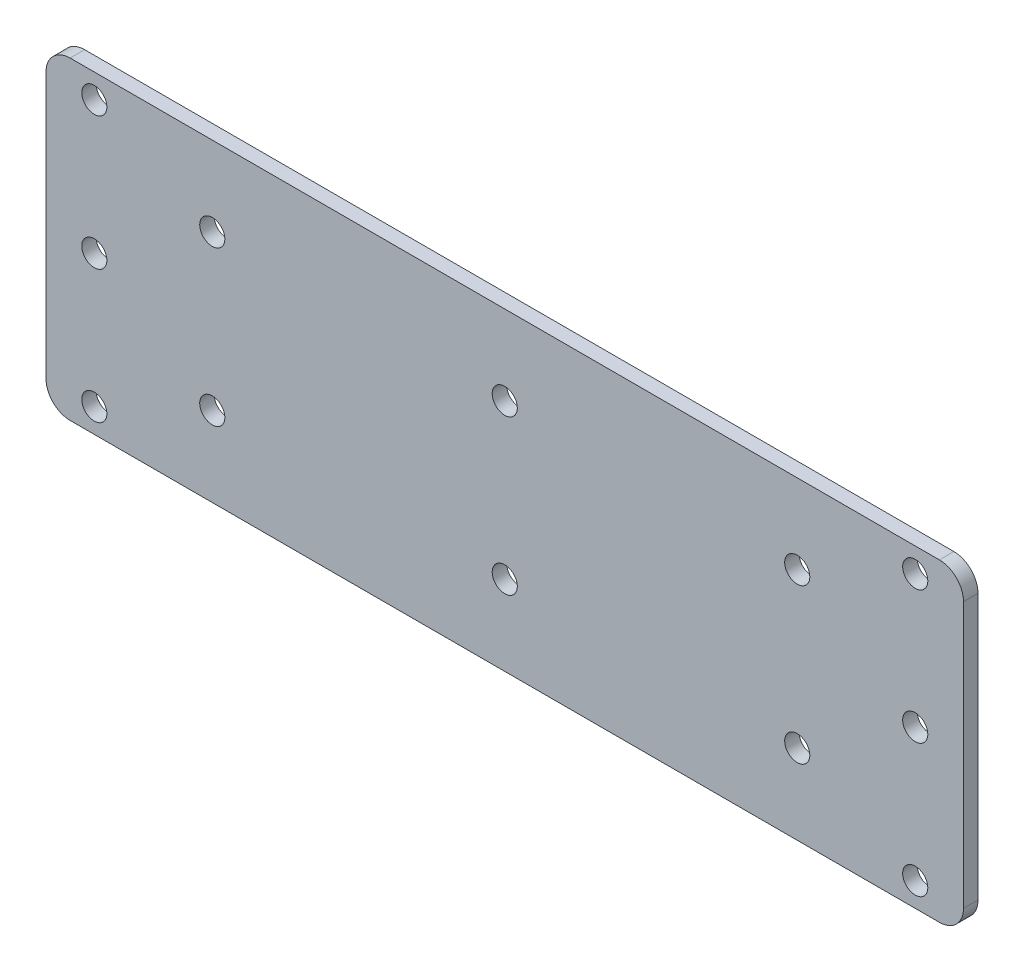
ISO-10303-21;
HEADER;
FILE_DESCRIPTION(('STEP AP214'),'2;1');
FILE_NAME('part.step','',(''),(''),'','','');
FILE_SCHEMA(('AUTOMOTIVE_DESIGN { 1 0 10303 214 1 1 1 1 }'));
ENDSEC;
DATA;
#1=APPLICATION_CONTEXT('core data for automotive mechanical design processes');
#2=APPLICATION_PROTOCOL_DEFINITION('international standard','automotive_design',2000,#1);
#3=PRODUCT_CONTEXT('',#1,'mechanical');
#4=PRODUCT('Part','Part','',(#3));
#5=PRODUCT_RELATED_PRODUCT_CATEGORY('part','',(#4));
#6=PRODUCT_DEFINITION_FORMATION('','',#4);
#7=PRODUCT_DEFINITION_CONTEXT('part definition',#1,'design');
#8=PRODUCT_DEFINITION('design','',#6,#7);
#9=PRODUCT_DEFINITION_SHAPE('','',#8);
#10=(LENGTH_UNIT() NAMED_UNIT(*) SI_UNIT(.MILLI.,.METRE.));
#11=(NAMED_UNIT(*) PLANE_ANGLE_UNIT() SI_UNIT($,.RADIAN.));
#12=(NAMED_UNIT(*) SI_UNIT($,.STERADIAN.) SOLID_ANGLE_UNIT());
#13=UNCERTAINTY_MEASURE_WITH_UNIT(LENGTH_MEASURE(1.E-05),#10,'distance_accuracy_value','');
#14=(GEOMETRIC_REPRESENTATION_CONTEXT(3) GLOBAL_UNCERTAINTY_ASSIGNED_CONTEXT((#13)) GLOBAL_UNIT_ASSIGNED_CONTEXT((#10,
#11,#12)) REPRESENTATION_CONTEXT('',''));
#15=CARTESIAN_POINT('',(0.,0.,0.));
#16=DIRECTION('',(0.,0.,1.));
#17=DIRECTION('',(1.,0.,0.));
#18=AXIS2_PLACEMENT_3D('',#15,#16,#17);
#19=CARTESIAN_POINT('',(0.,0.,3.));
#20=DIRECTION('',(0.,0.,1.));
#21=DIRECTION('',(1.,0.,0.));
#22=AXIS2_PLACEMENT_3D('',#19,#20,#21);
#23=PLANE('',#22);
#24=CARTESIAN_POINT('',(60.5639448145122,16.0292368422705,3.));
#25=DIRECTION('',(0.,0.,-1.));
#26=DIRECTION('',(-1.,0.,0.));
#27=AXIS2_PLACEMENT_3D('',#24,#25,#26);
#28=CIRCLE('',#27,2.6);
#29=CARTESIAN_POINT('',(57.9639448145121,16.0292368422705,3.));
#30=VERTEX_POINT('',#29);
#31=EDGE_CURVE('E385',#30,#30,#28,.T.);
#32=ORIENTED_EDGE('',*,*,#31,.T.);
#33=EDGE_LOOP('',(#32));
#34=FACE_BOUND('',#33,.T.);
#35=CARTESIAN_POINT('',(84.9961701361328,0.,3.));
#36=DIRECTION('',(0.,0.,-1.));
#37=DIRECTION('',(-1.,0.,0.));
#38=AXIS2_PLACEMENT_3D('',#35,#36,#37);
#39=CIRCLE('',#38,2.6);
#40=CARTESIAN_POINT('',(82.3961701361328,0.,3.));
#41=VERTEX_POINT('',#40);
#42=EDGE_CURVE('E389',#41,#41,#39,.T.);
#43=ORIENTED_EDGE('',*,*,#42,.T.);
#44=EDGE_LOOP('',(#43));
#45=FACE_BOUND('',#44,.T.);
#46=CARTESIAN_POINT('',(60.5639448145153,-15.9707631577294,3.));
#47=DIRECTION('',(0.,0.,-1.));
#48=DIRECTION('',(-1.,0.,0.));
#49=AXIS2_PLACEMENT_3D('',#46,#47,#48);
#50=CIRCLE('',#49,2.6);
#51=CARTESIAN_POINT('',(57.9639448145153,-15.9707631577294,3.));
#52=VERTEX_POINT('',#51);
#53=EDGE_CURVE('E400',#52,#52,#50,.T.);
#54=ORIENTED_EDGE('',*,*,#53,.T.);
#55=EDGE_LOOP('',(#54));
#56=FACE_BOUND('',#55,.T.);
#57=CARTESIAN_POINT('',(84.9961701361328,-27.5127460420702,3.));
#58=DIRECTION('',(0.,0.,-1.));
#59=DIRECTION('',(-1.,0.,0.));
#60=AXIS2_PLACEMENT_3D('',#57,#58,#59);
#61=CIRCLE('',#60,2.6);
#62=CARTESIAN_POINT('',(82.3961701361328,-27.5127460420702,3.));
#63=VERTEX_POINT('',#62);
#64=EDGE_CURVE('E406',#63,#63,#61,.T.);
#65=ORIENTED_EDGE('',*,*,#64,.T.);
#66=EDGE_LOOP('',(#65));
#67=FACE_BOUND('',#66,.T.);
#68=CARTESIAN_POINT('',(-0.0019149319335672,16.0292368422705,3.));
#69=DIRECTION('',(0.,0.,-1.));
#70=DIRECTION('',(-1.,0.,0.));
#71=AXIS2_PLACEMENT_3D('',#68,#69,#70);
#72=CIRCLE('',#71,2.6);
#73=CARTESIAN_POINT('',(-2.60191493193357,16.0292368422705,3.));
#74=VERTEX_POINT('',#73);
#75=EDGE_CURVE('E412',#74,#74,#72,.T.);
#76=ORIENTED_EDGE('',*,*,#75,.T.);
#77=EDGE_LOOP('',(#76));
#78=FACE_BOUND('',#77,.T.);
#79=CARTESIAN_POINT('',(-0.00191493193357414,-15.9707631577295,3.));
#80=DIRECTION('',(0.,0.,-1.));
#81=DIRECTION('',(-1.,0.,0.));
#82=AXIS2_PLACEMENT_3D('',#79,#80,#81);
#83=CIRCLE('',#82,2.6);
#84=CARTESIAN_POINT('',(-2.60191493193358,-15.9707631577295,3.));
#85=VERTEX_POINT('',#84);
#86=EDGE_CURVE('E418',#85,#85,#83,.T.);
#87=ORIENTED_EDGE('',*,*,#86,.T.);
#88=EDGE_LOOP('',(#87));
#89=FACE_BOUND('',#88,.T.);
#90=CARTESIAN_POINT('',(-84.9999999999999,-27.5127460420702,3.));
#91=DIRECTION('',(0.,0.,-1.));
#92=DIRECTION('',(1.,0.,0.));
#93=AXIS2_PLACEMENT_3D('',#90,#91,#92);
#94=CIRCLE('',#93,2.6);
#95=CARTESIAN_POINT('',(-82.3999999999999,-27.5127460420702,3.));
#96=VERTEX_POINT('',#95);
#97=EDGE_CURVE('E424',#96,#96,#94,.T.);
#98=ORIENTED_EDGE('',*,*,#97,.T.);
#99=EDGE_LOOP('',(#98));
#100=FACE_BOUND('',#99,.T.);
#101=CARTESIAN_POINT('',(-60.5677746783824,-15.9707631577294,3.));
#102=DIRECTION('',(0.,0.,-1.));
#103=DIRECTION('',(1.,0.,0.));
#104=AXIS2_PLACEMENT_3D('',#101,#102,#103);
#105=CIRCLE('',#104,2.6);
#106=CARTESIAN_POINT('',(-57.9677746783824,-15.9707631577294,3.));
#107=VERTEX_POINT('',#106);
#108=EDGE_CURVE('E430',#107,#107,#105,.T.);
#109=ORIENTED_EDGE('',*,*,#108,.T.);
#110=EDGE_LOOP('',(#109));
#111=FACE_BOUND('',#110,.T.);
#112=CARTESIAN_POINT('',(-84.9999999999999,0.,3.));
#113=DIRECTION('',(0.,0.,-1.));
#114=DIRECTION('',(1.,0.,0.));
#115=AXIS2_PLACEMENT_3D('',#112,#113,#114);
#116=CIRCLE('',#115,2.6);
#117=CARTESIAN_POINT('',(-82.3999999999999,0.,3.));
#118=VERTEX_POINT('',#117);
#119=EDGE_CURVE('E436',#118,#118,#116,.T.);
#120=ORIENTED_EDGE('',*,*,#119,.T.);
#121=EDGE_LOOP('',(#120));
#122=FACE_BOUND('',#121,.T.);
#123=CARTESIAN_POINT('',(-60.5677746783793,16.0292368422706,3.));
#124=DIRECTION('',(0.,0.,-1.));
#125=DIRECTION('',(1.,0.,0.));
#126=AXIS2_PLACEMENT_3D('',#123,#124,#125);
#127=CIRCLE('',#126,2.6);
#128=CARTESIAN_POINT('',(-57.9677746783793,16.0292368422706,3.));
#129=VERTEX_POINT('',#128);
#130=EDGE_CURVE('E454',#129,#129,#127,.T.);
#131=ORIENTED_EDGE('',*,*,#130,.T.);
#132=EDGE_LOOP('',(#131));
#133=FACE_BOUND('',#132,.T.);
#134=CARTESIAN_POINT('',(-84.9999999999999,27.5,3.));
#135=DIRECTION('',(0.,0.,-1.));
#136=DIRECTION('',(1.,0.,0.));
#137=AXIS2_PLACEMENT_3D('',#134,#135,#136);
#138=CIRCLE('',#137,2.6);
#139=CARTESIAN_POINT('',(-82.3999999999999,27.5,3.));
#140=VERTEX_POINT('',#139);
#141=EDGE_CURVE('E462',#140,#140,#138,.T.);
#142=ORIENTED_EDGE('',*,*,#141,.T.);
#143=EDGE_LOOP('',(#142));
#144=FACE_BOUND('',#143,.T.);
#145=CARTESIAN_POINT('',(84.9961701361328,27.5,3.));
#146=DIRECTION('',(0.,0.,-1.));
#147=DIRECTION('',(-1.,0.,0.));
#148=AXIS2_PLACEMENT_3D('',#145,#146,#147);
#149=CIRCLE('',#148,2.6);
#150=CARTESIAN_POINT('',(82.3961701361328,27.5,3.));
#151=VERTEX_POINT('',#150);
#152=EDGE_CURVE('E437',#151,#151,#149,.T.);
#153=ORIENTED_EDGE('',*,*,#152,.T.);
#154=EDGE_LOOP('',(#153));
#155=FACE_BOUND('',#154,.T.);
#156=DIRECTION('',(0.,1.,0.));
#157=VECTOR('',#156,1.);
#158=CARTESIAN_POINT('',(-95.,-32.5,3.));
#159=LINE('',#158,#157);
#160=CARTESIAN_POINT('',(-95.,-27.5,3.));
#161=VERTEX_POINT('',#160);
#162=CARTESIAN_POINT('',(-94.9999999999999,27.5,3.));
#163=VERTEX_POINT('',#162);
#164=EDGE_CURVE('E122',#161,#163,#159,.T.);
#165=ORIENTED_EDGE('',*,*,#164,.F.);
#166=CARTESIAN_POINT('',(-90.,-27.5,3.));
#167=DIRECTION('',(0.,0.,1.));
#168=DIRECTION('',(1.,0.,0.));
#169=AXIS2_PLACEMENT_3D('',#166,#167,#168);
#170=CIRCLE('',#169,5.);
#171=CARTESIAN_POINT('',(-90.,-32.5,3.));
#172=VERTEX_POINT('',#171);
#173=EDGE_CURVE('E105',#161,#172,#170,.T.);
#174=ORIENTED_EDGE('',*,*,#173,.T.);
#175=DIRECTION('',(1.,0.,0.));
#176=VECTOR('',#175,1.);
#177=CARTESIAN_POINT('',(-125.,-32.5,3.));
#178=LINE('',#177,#176);
#179=CARTESIAN_POINT('',(89.9961701361328,-32.5,3.));
#180=VERTEX_POINT('',#179);
#181=EDGE_CURVE('E140',#172,#180,#178,.T.);
#182=ORIENTED_EDGE('',*,*,#181,.T.);
#183=CARTESIAN_POINT('',(89.9961701361328,-27.5,3.));
#184=DIRECTION('',(0.,0.,1.));
#185=DIRECTION('',(1.,0.,0.));
#186=AXIS2_PLACEMENT_3D('',#183,#184,#185);
#187=CIRCLE('',#186,5.);
#188=CARTESIAN_POINT('',(94.9961701361328,-27.5,3.));
#189=VERTEX_POINT('',#188);
#190=EDGE_CURVE('E126',#180,#189,#187,.T.);
#191=ORIENTED_EDGE('',*,*,#190,.T.);
#192=DIRECTION('',(0.,-1.,0.));
#193=VECTOR('',#192,1.);
#194=CARTESIAN_POINT('',(94.9961701361328,-32.5,3.));
#195=LINE('',#194,#193);
#196=CARTESIAN_POINT('',(94.9961701361328,27.5,3.));
#197=VERTEX_POINT('',#196);
#198=EDGE_CURVE('E134',#197,#189,#195,.T.);
#199=ORIENTED_EDGE('',*,*,#198,.F.);
#200=CARTESIAN_POINT('',(89.9961701361328,27.5,3.));
#201=DIRECTION('',(0.,0.,1.));
#202=DIRECTION('',(1.,0.,0.));
#203=AXIS2_PLACEMENT_3D('',#200,#201,#202);
#204=CIRCLE('',#203,5.);
#205=CARTESIAN_POINT('',(89.9961701361328,32.5,3.));
#206=VERTEX_POINT('',#205);
#207=EDGE_CURVE('E149',#197,#206,#204,.T.);
#208=ORIENTED_EDGE('',*,*,#207,.T.);
#209=DIRECTION('',(-1.,0.,0.));
#210=VECTOR('',#209,1.);
#211=CARTESIAN_POINT('',(-125.,32.5,3.));
#212=LINE('',#211,#210);
#213=CARTESIAN_POINT('',(-89.9999999999999,32.5,3.));
#214=VERTEX_POINT('',#213);
#215=EDGE_CURVE('E138',#206,#214,#212,.T.);
#216=ORIENTED_EDGE('',*,*,#215,.T.);
#217=CARTESIAN_POINT('',(-89.9999999999999,27.5,3.));
#218=DIRECTION('',(0.,0.,1.));
#219=DIRECTION('',(1.,0.,0.));
#220=AXIS2_PLACEMENT_3D('',#217,#218,#219);
#221=CIRCLE('',#220,5.);
#222=EDGE_CURVE('E116',#214,#163,#221,.T.);
#223=ORIENTED_EDGE('',*,*,#222,.T.);
#224=EDGE_LOOP('',(#165,#174,#182,#191,#199,#208,#216,#223));
#225=FACE_BOUND('',#224,.T.);
#226=ADVANCED_FACE('F39',(#34,#45,#56,#67,#78,#89,#100,#111,#122,#133,#144,#155,#225),#23,.T.);
#227=CARTESIAN_POINT('',(0.,0.,0.));
#228=DIRECTION('',(0.,0.,1.));
#229=DIRECTION('',(1.,0.,0.));
#230=AXIS2_PLACEMENT_3D('',#227,#228,#229);
#231=PLANE('',#230);
#232=CARTESIAN_POINT('',(60.5639448145122,16.0292368422705,0.));
#233=DIRECTION('',(0.,0.,-1.));
#234=DIRECTION('',(-1.,0.,0.));
#235=AXIS2_PLACEMENT_3D('',#232,#233,#234);
#236=CIRCLE('',#235,2.6);
#237=CARTESIAN_POINT('',(57.9639448145121,16.0292368422705,0.));
#238=VERTEX_POINT('',#237);
#239=EDGE_CURVE('E388',#238,#238,#236,.T.);
#240=ORIENTED_EDGE('',*,*,#239,.F.);
#241=EDGE_LOOP('',(#240));
#242=FACE_BOUND('',#241,.T.);
#243=CARTESIAN_POINT('',(84.9961701361328,0.,0.));
#244=DIRECTION('',(0.,0.,-1.));
#245=DIRECTION('',(-1.,0.,0.));
#246=AXIS2_PLACEMENT_3D('',#243,#244,#245);
#247=CIRCLE('',#246,2.6);
#248=CARTESIAN_POINT('',(82.3961701361328,0.,0.));
#249=VERTEX_POINT('',#248);
#250=EDGE_CURVE('E394',#249,#249,#247,.T.);
#251=ORIENTED_EDGE('',*,*,#250,.F.);
#252=EDGE_LOOP('',(#251));
#253=FACE_BOUND('',#252,.T.);
#254=CARTESIAN_POINT('',(60.5639448145153,-15.9707631577294,0.));
#255=DIRECTION('',(0.,0.,-1.));
#256=DIRECTION('',(-1.,0.,0.));
#257=AXIS2_PLACEMENT_3D('',#254,#255,#256);
#258=CIRCLE('',#257,2.6);
#259=CARTESIAN_POINT('',(57.9639448145153,-15.9707631577294,0.));
#260=VERTEX_POINT('',#259);
#261=EDGE_CURVE('E403',#260,#260,#258,.T.);
#262=ORIENTED_EDGE('',*,*,#261,.F.);
#263=EDGE_LOOP('',(#262));
#264=FACE_BOUND('',#263,.T.);
#265=CARTESIAN_POINT('',(84.9961701361328,-27.5127460420702,0.));
#266=DIRECTION('',(0.,0.,-1.));
#267=DIRECTION('',(-1.,0.,0.));
#268=AXIS2_PLACEMENT_3D('',#265,#266,#267);
#269=CIRCLE('',#268,2.6);
#270=CARTESIAN_POINT('',(82.3961701361328,-27.5127460420702,0.));
#271=VERTEX_POINT('',#270);
#272=EDGE_CURVE('E409',#271,#271,#269,.T.);
#273=ORIENTED_EDGE('',*,*,#272,.F.);
#274=EDGE_LOOP('',(#273));
#275=FACE_BOUND('',#274,.T.);
#276=CARTESIAN_POINT('',(-0.0019149319335672,16.0292368422705,0.));
#277=DIRECTION('',(0.,0.,-1.));
#278=DIRECTION('',(-1.,0.,0.));
#279=AXIS2_PLACEMENT_3D('',#276,#277,#278);
#280=CIRCLE('',#279,2.6);
#281=CARTESIAN_POINT('',(-2.60191493193357,16.0292368422705,0.));
#282=VERTEX_POINT('',#281);
#283=EDGE_CURVE('E415',#282,#282,#280,.T.);
#284=ORIENTED_EDGE('',*,*,#283,.F.);
#285=EDGE_LOOP('',(#284));
#286=FACE_BOUND('',#285,.T.);
#287=CARTESIAN_POINT('',(-0.00191493193357414,-15.9707631577295,0.));
#288=DIRECTION('',(0.,0.,-1.));
#289=DIRECTION('',(-1.,0.,0.));
#290=AXIS2_PLACEMENT_3D('',#287,#288,#289);
#291=CIRCLE('',#290,2.6);
#292=CARTESIAN_POINT('',(-2.60191493193358,-15.9707631577295,0.));
#293=VERTEX_POINT('',#292);
#294=EDGE_CURVE('E421',#293,#293,#291,.T.);
#295=ORIENTED_EDGE('',*,*,#294,.F.);
#296=EDGE_LOOP('',(#295));
#297=FACE_BOUND('',#296,.T.);
#298=CARTESIAN_POINT('',(-84.9999999999999,-27.5127460420702,0.));
#299=DIRECTION('',(0.,0.,-1.));
#300=DIRECTION('',(1.,0.,0.));
#301=AXIS2_PLACEMENT_3D('',#298,#299,#300);
#302=CIRCLE('',#301,2.6);
#303=CARTESIAN_POINT('',(-82.3999999999999,-27.5127460420702,0.));
#304=VERTEX_POINT('',#303);
#305=EDGE_CURVE('E427',#304,#304,#302,.T.);
#306=ORIENTED_EDGE('',*,*,#305,.F.);
#307=EDGE_LOOP('',(#306));
#308=FACE_BOUND('',#307,.T.);
#309=CARTESIAN_POINT('',(-60.5677746783824,-15.9707631577294,0.));
#310=DIRECTION('',(0.,0.,-1.));
#311=DIRECTION('',(1.,0.,0.));
#312=AXIS2_PLACEMENT_3D('',#309,#310,#311);
#313=CIRCLE('',#312,2.6);
#314=CARTESIAN_POINT('',(-57.9677746783824,-15.9707631577294,0.));
#315=VERTEX_POINT('',#314);
#316=EDGE_CURVE('E433',#315,#315,#313,.T.);
#317=ORIENTED_EDGE('',*,*,#316,.F.);
#318=EDGE_LOOP('',(#317));
#319=FACE_BOUND('',#318,.T.);
#320=CARTESIAN_POINT('',(-84.9999999999999,0.,0.));
#321=DIRECTION('',(0.,0.,-1.));
#322=DIRECTION('',(1.,0.,0.));
#323=AXIS2_PLACEMENT_3D('',#320,#321,#322);
#324=CIRCLE('',#323,2.6);
#325=CARTESIAN_POINT('',(-82.3999999999999,0.,0.));
#326=VERTEX_POINT('',#325);
#327=EDGE_CURVE('E449',#326,#326,#324,.T.);
#328=ORIENTED_EDGE('',*,*,#327,.F.);
#329=EDGE_LOOP('',(#328));
#330=FACE_BOUND('',#329,.T.);
#331=CARTESIAN_POINT('',(-60.5677746783793,16.0292368422706,0.));
#332=DIRECTION('',(0.,0.,-1.));
#333=DIRECTION('',(1.,0.,0.));
#334=AXIS2_PLACEMENT_3D('',#331,#332,#333);
#335=CIRCLE('',#334,2.6);
#336=CARTESIAN_POINT('',(-57.9677746783793,16.0292368422706,0.));
#337=VERTEX_POINT('',#336);
#338=EDGE_CURVE('E459',#337,#337,#335,.T.);
#339=ORIENTED_EDGE('',*,*,#338,.F.);
#340=EDGE_LOOP('',(#339));
#341=FACE_BOUND('',#340,.T.);
#342=CARTESIAN_POINT('',(-84.9999999999999,27.5,0.));
#343=DIRECTION('',(0.,0.,-1.));
#344=DIRECTION('',(1.,0.,0.));
#345=AXIS2_PLACEMENT_3D('',#342,#343,#344);
#346=CIRCLE('',#345,2.6);
#347=CARTESIAN_POINT('',(-82.3999999999999,27.5,0.));
#348=VERTEX_POINT('',#347);
#349=EDGE_CURVE('E464',#348,#348,#346,.T.);
#350=ORIENTED_EDGE('',*,*,#349,.F.);
#351=EDGE_LOOP('',(#350));
#352=FACE_BOUND('',#351,.T.);
#353=CARTESIAN_POINT('',(84.9961701361328,27.5,0.));
#354=DIRECTION('',(0.,0.,-1.));
#355=DIRECTION('',(-1.,0.,0.));
#356=AXIS2_PLACEMENT_3D('',#353,#354,#355);
#357=CIRCLE('',#356,2.6);
#358=CARTESIAN_POINT('',(82.3961701361328,27.5,0.));
#359=VERTEX_POINT('',#358);
#360=EDGE_CURVE('E391',#359,#359,#357,.T.);
#361=ORIENTED_EDGE('',*,*,#360,.F.);
#362=EDGE_LOOP('',(#361));
#363=FACE_BOUND('',#362,.T.);
#364=DIRECTION('',(1.,0.,0.));
#365=VECTOR('',#364,1.);
#366=CARTESIAN_POINT('',(-125.,-32.5,0.));
#367=LINE('',#366,#365);
#368=CARTESIAN_POINT('',(-90.,-32.5,0.));
#369=VERTEX_POINT('',#368);
#370=CARTESIAN_POINT('',(89.9961701361328,-32.5,0.));
#371=VERTEX_POINT('',#370);
#372=EDGE_CURVE('E141',#369,#371,#367,.T.);
#373=ORIENTED_EDGE('',*,*,#372,.F.);
#374=CARTESIAN_POINT('',(-90.,-27.5,0.));
#375=DIRECTION('',(0.,0.,1.));
#376=DIRECTION('',(1.,0.,0.));
#377=AXIS2_PLACEMENT_3D('',#374,#375,#376);
#378=CIRCLE('',#377,5.);
#379=CARTESIAN_POINT('',(-95.,-27.5,0.));
#380=VERTEX_POINT('',#379);
#381=EDGE_CURVE('E160',#369,#380,#378,.F.);
#382=ORIENTED_EDGE('',*,*,#381,.T.);
#383=DIRECTION('',(0.,1.,0.));
#384=VECTOR('',#383,1.);
#385=CARTESIAN_POINT('',(-95.,0.,0.));
#386=LINE('',#385,#384);
#387=CARTESIAN_POINT('',(-94.9999999999999,27.5,0.));
#388=VERTEX_POINT('',#387);
#389=EDGE_CURVE('E125',#380,#388,#386,.T.);
#390=ORIENTED_EDGE('',*,*,#389,.T.);
#391=CARTESIAN_POINT('',(-89.9999999999999,27.5,0.));
#392=DIRECTION('',(0.,0.,1.));
#393=DIRECTION('',(1.,0.,0.));
#394=AXIS2_PLACEMENT_3D('',#391,#392,#393);
#395=CIRCLE('',#394,5.);
#396=CARTESIAN_POINT('',(-89.9999999999999,32.5,0.));
#397=VERTEX_POINT('',#396);
#398=EDGE_CURVE('E158',#388,#397,#395,.F.);
#399=ORIENTED_EDGE('',*,*,#398,.T.);
#400=DIRECTION('',(-1.,0.,0.));
#401=VECTOR('',#400,1.);
#402=CARTESIAN_POINT('',(-125.,32.5,0.));
#403=LINE('',#402,#401);
#404=CARTESIAN_POINT('',(89.9961701361328,32.5,0.));
#405=VERTEX_POINT('',#404);
#406=EDGE_CURVE('E132',#405,#397,#403,.T.);
#407=ORIENTED_EDGE('',*,*,#406,.F.);
#408=CARTESIAN_POINT('',(89.9961701361328,27.5,0.));
#409=DIRECTION('',(0.,0.,1.));
#410=DIRECTION('',(1.,0.,0.));
#411=AXIS2_PLACEMENT_3D('',#408,#409,#410);
#412=CIRCLE('',#411,5.);
#413=CARTESIAN_POINT('',(94.9961701361328,27.5,0.));
#414=VERTEX_POINT('',#413);
#415=EDGE_CURVE('E60',#405,#414,#412,.F.);
#416=ORIENTED_EDGE('',*,*,#415,.T.);
#417=DIRECTION('',(0.,-1.,0.));
#418=VECTOR('',#417,1.);
#419=CARTESIAN_POINT('',(94.9961701361328,0.,0.));
#420=LINE('',#419,#418);
#421=CARTESIAN_POINT('',(94.9961701361328,-27.5,0.));
#422=VERTEX_POINT('',#421);
#423=EDGE_CURVE('E130',#414,#422,#420,.T.);
#424=ORIENTED_EDGE('',*,*,#423,.T.);
#425=CARTESIAN_POINT('',(89.9961701361328,-27.5,0.));
#426=DIRECTION('',(0.,0.,1.));
#427=DIRECTION('',(1.,0.,0.));
#428=AXIS2_PLACEMENT_3D('',#425,#426,#427);
#429=CIRCLE('',#428,5.);
#430=EDGE_CURVE('E155',#422,#371,#429,.F.);
#431=ORIENTED_EDGE('',*,*,#430,.T.);
#432=EDGE_LOOP('',(#373,#382,#390,#399,#407,#416,#424,#431));
#433=FACE_BOUND('',#432,.T.);
#434=ADVANCED_FACE('F180',(#242,#253,#264,#275,#286,#297,#308,#319,#330,#341,#352,#363,#433),
#231,.F.);
#435=CARTESIAN_POINT('',(-125.,32.5,3.));
#436=DIRECTION('',(0.,-1.,0.));
#437=DIRECTION('',(0.,0.,-1.));
#438=AXIS2_PLACEMENT_3D('',#435,#436,#437);
#439=PLANE('',#438);
#440=ORIENTED_EDGE('',*,*,#406,.T.);
#441=DIRECTION('',(0.,0.,1.));
#442=VECTOR('',#441,1.);
#443=CARTESIAN_POINT('',(-89.9999999999999,32.5,3.));
#444=LINE('',#443,#442);
#445=EDGE_CURVE('E164',#397,#214,#444,.T.);
#446=ORIENTED_EDGE('',*,*,#445,.T.);
#447=ORIENTED_EDGE('',*,*,#215,.F.);
#448=DIRECTION('',(0.,0.,1.));
#449=VECTOR('',#448,1.);
#450=CARTESIAN_POINT('',(89.9961701361328,32.5,3.));
#451=LINE('',#450,#449);
#452=EDGE_CURVE('E162',#206,#405,#451,.F.);
#453=ORIENTED_EDGE('',*,*,#452,.T.);
#454=EDGE_LOOP('',(#440,#446,#447,#453));
#455=FACE_BOUND('',#454,.T.);
#456=ADVANCED_FACE('F169',(#455),#439,.F.);
#457=CARTESIAN_POINT('',(-125.,-32.5,3.));
#458=DIRECTION('',(0.,1.,0.));
#459=DIRECTION('',(0.,0.,1.));
#460=AXIS2_PLACEMENT_3D('',#457,#458,#459);
#461=PLANE('',#460);
#462=ORIENTED_EDGE('',*,*,#181,.F.);
#463=DIRECTION('',(0.,0.,1.));
#464=VECTOR('',#463,1.);
#465=CARTESIAN_POINT('',(-90.,-32.5,3.));
#466=LINE('',#465,#464);
#467=EDGE_CURVE('E110',#172,#369,#466,.F.);
#468=ORIENTED_EDGE('',*,*,#467,.T.);
#469=ORIENTED_EDGE('',*,*,#372,.T.);
#470=DIRECTION('',(0.,0.,1.));
#471=VECTOR('',#470,1.);
#472=CARTESIAN_POINT('',(89.9961701361328,-32.5,3.));
#473=LINE('',#472,#471);
#474=EDGE_CURVE('E115',#371,#180,#473,.T.);
#475=ORIENTED_EDGE('',*,*,#474,.T.);
#476=EDGE_LOOP('',(#462,#468,#469,#475));
#477=FACE_BOUND('',#476,.T.);
#478=ADVANCED_FACE('F184',(#477),#461,.F.);
#479=CARTESIAN_POINT('',(-95.,-32.5,-2.));
#480=DIRECTION('',(1.,0.,0.));
#481=DIRECTION('',(0.,1.,0.));
#482=AXIS2_PLACEMENT_3D('',#479,#480,#481);
#483=PLANE('',#482);
#484=ORIENTED_EDGE('',*,*,#389,.F.);
#485=DIRECTION('',(0.,0.,1.));
#486=VECTOR('',#485,1.);
#487=CARTESIAN_POINT('',(-95.,-27.5,-2.));
#488=LINE('',#487,#486);
#489=EDGE_CURVE('E109',#380,#161,#488,.T.);
#490=ORIENTED_EDGE('',*,*,#489,.T.);
#491=ORIENTED_EDGE('',*,*,#164,.T.);
#492=DIRECTION('',(0.,0.,1.));
#493=VECTOR('',#492,1.);
#494=CARTESIAN_POINT('',(-94.9999999999999,27.5,-2.));
#495=LINE('',#494,#493);
#496=EDGE_CURVE('E127',#163,#388,#495,.F.);
#497=ORIENTED_EDGE('',*,*,#496,.T.);
#498=EDGE_LOOP('',(#484,#490,#491,#497));
#499=FACE_BOUND('',#498,.T.);
#500=ADVANCED_FACE('F121',(#499),#483,.F.);
#501=CARTESIAN_POINT('',(94.9961701361328,-32.5,-2.));
#502=DIRECTION('',(-1.,0.,0.));
#503=DIRECTION('',(0.,0.,1.));
#504=AXIS2_PLACEMENT_3D('',#501,#502,#503);
#505=PLANE('',#504);
#506=ORIENTED_EDGE('',*,*,#423,.F.);
#507=DIRECTION('',(0.,0.,1.));
#508=VECTOR('',#507,1.);
#509=CARTESIAN_POINT('',(94.9961701361328,27.5,-2.));
#510=LINE('',#509,#508);
#511=EDGE_CURVE('E11',#414,#197,#510,.T.);
#512=ORIENTED_EDGE('',*,*,#511,.T.);
#513=ORIENTED_EDGE('',*,*,#198,.T.);
#514=DIRECTION('',(0.,0.,1.));
#515=VECTOR('',#514,1.);
#516=CARTESIAN_POINT('',(94.9961701361328,-27.5,-2.));
#517=LINE('',#516,#515);
#518=EDGE_CURVE('E47',#189,#422,#517,.F.);
#519=ORIENTED_EDGE('',*,*,#518,.T.);
#520=EDGE_LOOP('',(#506,#512,#513,#519));
#521=FACE_BOUND('',#520,.T.);
#522=ADVANCED_FACE('F177',(#521),#505,.F.);
#523=CARTESIAN_POINT('',(-90.,-27.5,-2.));
#524=DIRECTION('',(0.,0.,1.));
#525=DIRECTION('',(1.,0.,0.));
#526=AXIS2_PLACEMENT_3D('',#523,#524,#525);
#527=CYLINDRICAL_SURFACE('',#526,5.);
#528=ORIENTED_EDGE('',*,*,#381,.F.);
#529=ORIENTED_EDGE('',*,*,#467,.F.);
#530=ORIENTED_EDGE('',*,*,#173,.F.);
#531=ORIENTED_EDGE('',*,*,#489,.F.);
#532=EDGE_LOOP('',(#528,#529,#530,#531));
#533=FACE_BOUND('',#532,.T.);
#534=ADVANCED_FACE('F108',(#533),#527,.T.);
#535=CARTESIAN_POINT('',(-89.9999999999999,27.5,3.));
#536=DIRECTION('',(0.,0.,1.));
#537=DIRECTION('',(1.,0.,0.));
#538=AXIS2_PLACEMENT_3D('',#535,#536,#537);
#539=CYLINDRICAL_SURFACE('',#538,5.);
#540=ORIENTED_EDGE('',*,*,#398,.F.);
#541=ORIENTED_EDGE('',*,*,#496,.F.);
#542=ORIENTED_EDGE('',*,*,#222,.F.);
#543=ORIENTED_EDGE('',*,*,#445,.F.);
#544=EDGE_LOOP('',(#540,#541,#542,#543));
#545=FACE_BOUND('',#544,.T.);
#546=ADVANCED_FACE('F185',(#545),#539,.T.);
#547=CARTESIAN_POINT('',(89.9961701361328,27.5,-2.));
#548=DIRECTION('',(0.,0.,1.));
#549=DIRECTION('',(1.,0.,0.));
#550=AXIS2_PLACEMENT_3D('',#547,#548,#549);
#551=CYLINDRICAL_SURFACE('',#550,5.);
#552=ORIENTED_EDGE('',*,*,#415,.F.);
#553=ORIENTED_EDGE('',*,*,#452,.F.);
#554=ORIENTED_EDGE('',*,*,#207,.F.);
#555=ORIENTED_EDGE('',*,*,#511,.F.);
#556=EDGE_LOOP('',(#552,#553,#554,#555));
#557=FACE_BOUND('',#556,.T.);
#558=ADVANCED_FACE('F176',(#557),#551,.T.);
#559=CARTESIAN_POINT('',(89.9961701361328,-27.5,3.));
#560=DIRECTION('',(0.,0.,1.));
#561=DIRECTION('',(1.,0.,0.));
#562=AXIS2_PLACEMENT_3D('',#559,#560,#561);
#563=CYLINDRICAL_SURFACE('',#562,5.);
#564=ORIENTED_EDGE('',*,*,#430,.F.);
#565=ORIENTED_EDGE('',*,*,#518,.F.);
#566=ORIENTED_EDGE('',*,*,#190,.F.);
#567=ORIENTED_EDGE('',*,*,#474,.F.);
#568=EDGE_LOOP('',(#564,#565,#566,#567));
#569=FACE_BOUND('',#568,.T.);
#570=ADVANCED_FACE('F41',(#569),#563,.T.);
#571=CARTESIAN_POINT('',(84.9961701361328,27.5,3.));
#572=DIRECTION('',(0.,0.,-1.));
#573=DIRECTION('',(-1.,0.,0.));
#574=AXIS2_PLACEMENT_3D('',#571,#572,#573);
#575=CYLINDRICAL_SURFACE('',#574,2.6);
#576=ORIENTED_EDGE('',*,*,#152,.F.);
#577=EDGE_LOOP('',(#576));
#578=FACE_BOUND('',#577,.T.);
#579=ORIENTED_EDGE('',*,*,#360,.T.);
#580=EDGE_LOOP('',(#579));
#581=FACE_BOUND('',#580,.T.);
#582=ADVANCED_FACE('F249',(#578,#581),#575,.F.);
#583=CARTESIAN_POINT('',(-84.9999999999999,27.5,3.));
#584=DIRECTION('',(0.,0.,-1.));
#585=DIRECTION('',(-1.,0.,0.));
#586=AXIS2_PLACEMENT_3D('',#583,#584,#585);
#587=CYLINDRICAL_SURFACE('',#586,2.6);
#588=ORIENTED_EDGE('',*,*,#141,.F.);
#589=EDGE_LOOP('',(#588));
#590=FACE_BOUND('',#589,.T.);
#591=ORIENTED_EDGE('',*,*,#349,.T.);
#592=EDGE_LOOP('',(#591));
#593=FACE_BOUND('',#592,.T.);
#594=ADVANCED_FACE('F269',(#590,#593),#587,.F.);
#595=CARTESIAN_POINT('',(-60.5677746783793,16.0292368422706,3.));
#596=DIRECTION('',(0.,0.,-1.));
#597=DIRECTION('',(-1.,0.,0.));
#598=AXIS2_PLACEMENT_3D('',#595,#596,#597);
#599=CYLINDRICAL_SURFACE('',#598,2.6);
#600=ORIENTED_EDGE('',*,*,#130,.F.);
#601=EDGE_LOOP('',(#600));
#602=FACE_BOUND('',#601,.T.);
#603=ORIENTED_EDGE('',*,*,#338,.T.);
#604=EDGE_LOOP('',(#603));
#605=FACE_BOUND('',#604,.T.);
#606=ADVANCED_FACE('F279',(#602,#605),#599,.F.);
#607=CARTESIAN_POINT('',(-84.9999999999999,0.,3.));
#608=DIRECTION('',(0.,0.,-1.));
#609=DIRECTION('',(-1.,0.,0.));
#610=AXIS2_PLACEMENT_3D('',#607,#608,#609);
#611=CYLINDRICAL_SURFACE('',#610,2.6);
#612=ORIENTED_EDGE('',*,*,#119,.F.);
#613=EDGE_LOOP('',(#612));
#614=FACE_BOUND('',#613,.T.);
#615=ORIENTED_EDGE('',*,*,#327,.T.);
#616=EDGE_LOOP('',(#615));
#617=FACE_BOUND('',#616,.T.);
#618=ADVANCED_FACE('F289',(#614,#617),#611,.F.);
#619=CARTESIAN_POINT('',(-60.5677746783824,-15.9707631577294,3.));
#620=DIRECTION('',(0.,0.,-1.));
#621=DIRECTION('',(-1.,0.,0.));
#622=AXIS2_PLACEMENT_3D('',#619,#620,#621);
#623=CYLINDRICAL_SURFACE('',#622,2.6);
#624=ORIENTED_EDGE('',*,*,#108,.F.);
#625=EDGE_LOOP('',(#624));
#626=FACE_BOUND('',#625,.T.);
#627=ORIENTED_EDGE('',*,*,#316,.T.);
#628=EDGE_LOOP('',(#627));
#629=FACE_BOUND('',#628,.T.);
#630=ADVANCED_FACE('F299',(#626,#629),#623,.F.);
#631=CARTESIAN_POINT('',(-84.9999999999999,-27.5127460420702,3.));
#632=DIRECTION('',(0.,0.,-1.));
#633=DIRECTION('',(-1.,0.,0.));
#634=AXIS2_PLACEMENT_3D('',#631,#632,#633);
#635=CYLINDRICAL_SURFACE('',#634,2.6);
#636=ORIENTED_EDGE('',*,*,#97,.F.);
#637=EDGE_LOOP('',(#636));
#638=FACE_BOUND('',#637,.T.);
#639=ORIENTED_EDGE('',*,*,#305,.T.);
#640=EDGE_LOOP('',(#639));
#641=FACE_BOUND('',#640,.T.);
#642=ADVANCED_FACE('F309',(#638,#641),#635,.F.);
#643=CARTESIAN_POINT('',(-0.00191493193357414,-15.9707631577295,3.));
#644=DIRECTION('',(0.,0.,-1.));
#645=DIRECTION('',(-1.,0.,0.));
#646=AXIS2_PLACEMENT_3D('',#643,#644,#645);
#647=CYLINDRICAL_SURFACE('',#646,2.6);
#648=ORIENTED_EDGE('',*,*,#86,.F.);
#649=EDGE_LOOP('',(#648));
#650=FACE_BOUND('',#649,.T.);
#651=ORIENTED_EDGE('',*,*,#294,.T.);
#652=EDGE_LOOP('',(#651));
#653=FACE_BOUND('',#652,.T.);
#654=ADVANCED_FACE('F319',(#650,#653),#647,.F.);
#655=CARTESIAN_POINT('',(-0.0019149319335672,16.0292368422705,3.));
#656=DIRECTION('',(0.,0.,-1.));
#657=DIRECTION('',(-1.,0.,0.));
#658=AXIS2_PLACEMENT_3D('',#655,#656,#657);
#659=CYLINDRICAL_SURFACE('',#658,2.6);
#660=ORIENTED_EDGE('',*,*,#75,.F.);
#661=EDGE_LOOP('',(#660));
#662=FACE_BOUND('',#661,.T.);
#663=ORIENTED_EDGE('',*,*,#283,.T.);
#664=EDGE_LOOP('',(#663));
#665=FACE_BOUND('',#664,.T.);
#666=ADVANCED_FACE('F329',(#662,#665),#659,.F.);
#667=CARTESIAN_POINT('',(84.9961701361328,-27.5127460420702,3.));
#668=DIRECTION('',(0.,0.,-1.));
#669=DIRECTION('',(-1.,0.,0.));
#670=AXIS2_PLACEMENT_3D('',#667,#668,#669);
#671=CYLINDRICAL_SURFACE('',#670,2.6);
#672=ORIENTED_EDGE('',*,*,#64,.F.);
#673=EDGE_LOOP('',(#672));
#674=FACE_BOUND('',#673,.T.);
#675=ORIENTED_EDGE('',*,*,#272,.T.);
#676=EDGE_LOOP('',(#675));
#677=FACE_BOUND('',#676,.T.);
#678=ADVANCED_FACE('F339',(#674,#677),#671,.F.);
#679=CARTESIAN_POINT('',(60.5639448145153,-15.9707631577294,3.));
#680=DIRECTION('',(0.,0.,-1.));
#681=DIRECTION('',(-1.,0.,0.));
#682=AXIS2_PLACEMENT_3D('',#679,#680,#681);
#683=CYLINDRICAL_SURFACE('',#682,2.6);
#684=ORIENTED_EDGE('',*,*,#53,.F.);
#685=EDGE_LOOP('',(#684));
#686=FACE_BOUND('',#685,.T.);
#687=ORIENTED_EDGE('',*,*,#261,.T.);
#688=EDGE_LOOP('',(#687));
#689=FACE_BOUND('',#688,.T.);
#690=ADVANCED_FACE('F349',(#686,#689),#683,.F.);
#691=CARTESIAN_POINT('',(84.9961701361328,0.,3.));
#692=DIRECTION('',(0.,0.,-1.));
#693=DIRECTION('',(-1.,0.,0.));
#694=AXIS2_PLACEMENT_3D('',#691,#692,#693);
#695=CYLINDRICAL_SURFACE('',#694,2.6);
#696=ORIENTED_EDGE('',*,*,#42,.F.);
#697=EDGE_LOOP('',(#696));
#698=FACE_BOUND('',#697,.T.);
#699=ORIENTED_EDGE('',*,*,#250,.T.);
#700=EDGE_LOOP('',(#699));
#701=FACE_BOUND('',#700,.T.);
#702=ADVANCED_FACE('F359',(#698,#701),#695,.F.);
#703=CARTESIAN_POINT('',(60.5639448145122,16.0292368422705,3.));
#704=DIRECTION('',(0.,0.,-1.));
#705=DIRECTION('',(-1.,0.,0.));
#706=AXIS2_PLACEMENT_3D('',#703,#704,#705);
#707=CYLINDRICAL_SURFACE('',#706,2.6);
#708=ORIENTED_EDGE('',*,*,#31,.F.);
#709=EDGE_LOOP('',(#708));
#710=FACE_BOUND('',#709,.T.);
#711=ORIENTED_EDGE('',*,*,#239,.T.);
#712=EDGE_LOOP('',(#711));
#713=FACE_BOUND('',#712,.T.);
#714=ADVANCED_FACE('F369',(#710,#713),#707,.F.);
#715=CLOSED_SHELL('',(#226,#434,#456,#478,#500,#522,#534,#546,#558,#570,#582,#594,#606,#618,
#630,#642,#654,#666,#678,#690,#702,#714));
#716=MANIFOLD_SOLID_BREP('B2',#715);
#717=ADVANCED_BREP_SHAPE_REPRESENTATION('',(#18,#716),#14);
#718=SHAPE_DEFINITION_REPRESENTATION(#9,#717);
ENDSEC;
END-ISO-10303-21;
